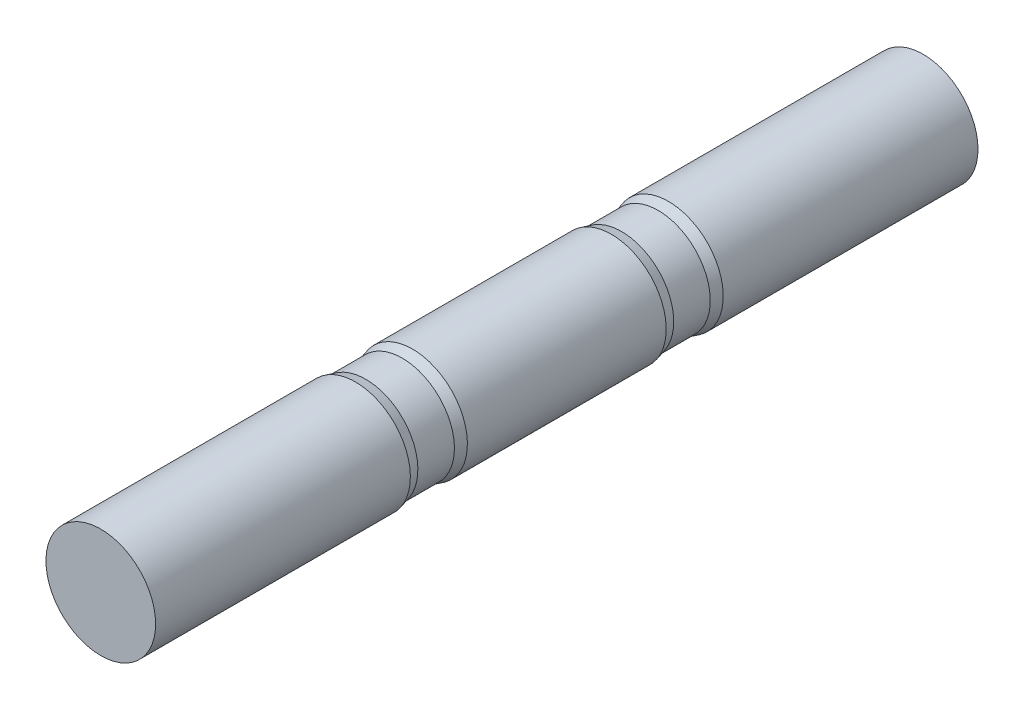
ISO-10303-21;
HEADER;
FILE_DESCRIPTION(('STEP AP214'),'2;1');
FILE_NAME('part.step','',(''),(''),'','','');
FILE_SCHEMA(('AUTOMOTIVE_DESIGN { 1 0 10303 214 1 1 1 1 }'));
ENDSEC;
DATA;
#1=APPLICATION_CONTEXT('core data for automotive mechanical design processes');
#2=APPLICATION_PROTOCOL_DEFINITION('international standard','automotive_design',2000,#1);
#3=PRODUCT_CONTEXT('',#1,'mechanical');
#4=PRODUCT('Part','Part','',(#3));
#5=PRODUCT_RELATED_PRODUCT_CATEGORY('part','',(#4));
#6=PRODUCT_DEFINITION_FORMATION('','',#4);
#7=PRODUCT_DEFINITION_CONTEXT('part definition',#1,'design');
#8=PRODUCT_DEFINITION('design','',#6,#7);
#9=PRODUCT_DEFINITION_SHAPE('','',#8);
#10=(LENGTH_UNIT() NAMED_UNIT(*) SI_UNIT(.MILLI.,.METRE.));
#11=(NAMED_UNIT(*) PLANE_ANGLE_UNIT() SI_UNIT($,.RADIAN.));
#12=(NAMED_UNIT(*) SI_UNIT($,.STERADIAN.) SOLID_ANGLE_UNIT());
#13=UNCERTAINTY_MEASURE_WITH_UNIT(LENGTH_MEASURE(1.E-05),#10,'distance_accuracy_value','');
#14=(GEOMETRIC_REPRESENTATION_CONTEXT(3) GLOBAL_UNCERTAINTY_ASSIGNED_CONTEXT((#13)) GLOBAL_UNIT_ASSIGNED_CONTEXT((#10,
#11,#12)) REPRESENTATION_CONTEXT('',''));
#15=CARTESIAN_POINT('',(0.,0.,0.));
#16=DIRECTION('',(0.,0.,1.));
#17=DIRECTION('',(1.,0.,0.));
#18=AXIS2_PLACEMENT_3D('',#15,#16,#17);
#19=CARTESIAN_POINT('',(0.,0.,225.));
#20=DIRECTION('',(0.,0.,-1.));
#21=DIRECTION('',(-1.,0.,0.));
#22=AXIS2_PLACEMENT_3D('',#19,#20,#21);
#23=CYLINDRICAL_SURFACE('',#22,30.);
#24=CARTESIAN_POINT('',(0.,0.,54.4019237886467));
#25=DIRECTION('',(0.,0.,1.));
#26=DIRECTION('',(0.,-1.,0.));
#27=AXIS2_PLACEMENT_3D('',#24,#25,#26);
#28=CIRCLE('',#27,30.);
#29=CARTESIAN_POINT('',(0.,-30.0000000000001,54.4019237886467));
#30=VERTEX_POINT('',#29);
#31=EDGE_CURVE('E52',#30,#30,#28,.T.);
#32=ORIENTED_EDGE('',*,*,#31,.F.);
#33=EDGE_LOOP('',(#32));
#34=FACE_BOUND('',#33,.T.);
#35=CARTESIAN_POINT('',(0.,0.,-54.4019237886467));
#36=DIRECTION('',(0.,0.,1.));
#37=DIRECTION('',(0.,-1.,0.));
#38=AXIS2_PLACEMENT_3D('',#35,#36,#37);
#39=CIRCLE('',#38,30.);
#40=CARTESIAN_POINT('',(0.,-30.,-54.4019237886467));
#41=VERTEX_POINT('',#40);
#42=EDGE_CURVE('E61',#41,#41,#39,.T.);
#43=ORIENTED_EDGE('',*,*,#42,.T.);
#44=EDGE_LOOP('',(#43));
#45=FACE_BOUND('',#44,.T.);
#46=ADVANCED_FACE('F31',(#34,#45),#23,.T.);
#47=CARTESIAN_POINT('',(0.,0.,225.));
#48=DIRECTION('',(0.,0.,1.));
#49=DIRECTION('',(1.,0.,0.));
#50=AXIS2_PLACEMENT_3D('',#47,#48,#49);
#51=CIRCLE('',#50,30.);
#52=CARTESIAN_POINT('',(30.,0.,225.));
#53=VERTEX_POINT('',#52);
#54=EDGE_CURVE('E10',#53,#53,#51,.T.);
#55=ORIENTED_EDGE('',*,*,#54,.F.);
#56=EDGE_LOOP('',(#55));
#57=FACE_BOUND('',#56,.T.);
#58=CARTESIAN_POINT('',(0.,0.,85.5980762113533));
#59=DIRECTION('',(0.,0.,1.));
#60=DIRECTION('',(0.,-1.,0.));
#61=AXIS2_PLACEMENT_3D('',#58,#59,#60);
#62=CIRCLE('',#61,30.);
#63=CARTESIAN_POINT('',(0.,-30.0000000000001,85.5980762113533));
#64=VERTEX_POINT('',#63);
#65=EDGE_CURVE('E42',#64,#64,#62,.T.);
#66=ORIENTED_EDGE('',*,*,#65,.T.);
#67=EDGE_LOOP('',(#66));
#68=FACE_BOUND('',#67,.T.);
#69=ADVANCED_FACE('F33',(#57,#68),#23,.T.);
#70=CARTESIAN_POINT('',(0.,0.,225.));
#71=DIRECTION('',(0.,0.,1.));
#72=DIRECTION('',(1.,0.,0.));
#73=AXIS2_PLACEMENT_3D('',#70,#71,#72);
#74=PLANE('',#73);
#75=ORIENTED_EDGE('',*,*,#54,.T.);
#76=EDGE_LOOP('',(#75));
#77=FACE_BOUND('',#76,.T.);
#78=ADVANCED_FACE('F83',(#77),#74,.T.);
#79=CARTESIAN_POINT('',(0.,0.,85.5980762113533));
#80=DIRECTION('',(0.,0.,1.));
#81=DIRECTION('',(0.,-1.,0.));
#82=AXIS2_PLACEMENT_3D('',#79,#80,#81);
#83=CONICAL_SURFACE('',#82,30.,0.261799387799149);
#84=CARTESIAN_POINT('',(0.,0.,80.));
#85=DIRECTION('',(0.,0.,1.));
#86=DIRECTION('',(0.,-1.,0.));
#87=AXIS2_PLACEMENT_3D('',#84,#85,#86);
#88=CIRCLE('',#87,28.5);
#89=CARTESIAN_POINT('',(0.,-28.5000000000001,80.));
#90=VERTEX_POINT('',#89);
#91=EDGE_CURVE('E46',#90,#90,#88,.T.);
#92=ORIENTED_EDGE('',*,*,#91,.T.);
#93=EDGE_LOOP('',(#92));
#94=FACE_BOUND('',#93,.T.);
#95=ORIENTED_EDGE('',*,*,#65,.F.);
#96=EDGE_LOOP('',(#95));
#97=FACE_BOUND('',#96,.T.);
#98=ADVANCED_FACE('F88',(#94,#97),#83,.T.);
#99=CARTESIAN_POINT('',(0.,0.,225.));
#100=DIRECTION('',(0.,0.,1.));
#101=DIRECTION('',(0.,-1.,0.));
#102=AXIS2_PLACEMENT_3D('',#99,#100,#101);
#103=CYLINDRICAL_SURFACE('',#102,28.5);
#104=CARTESIAN_POINT('',(0.,0.,60.));
#105=DIRECTION('',(0.,0.,1.));
#106=DIRECTION('',(0.,-1.,0.));
#107=AXIS2_PLACEMENT_3D('',#104,#105,#106);
#108=CIRCLE('',#107,28.5);
#109=CARTESIAN_POINT('',(0.,-28.5000000000001,60.));
#110=VERTEX_POINT('',#109);
#111=EDGE_CURVE('E49',#110,#110,#108,.T.);
#112=ORIENTED_EDGE('',*,*,#111,.T.);
#113=EDGE_LOOP('',(#112));
#114=FACE_BOUND('',#113,.T.);
#115=ORIENTED_EDGE('',*,*,#91,.F.);
#116=EDGE_LOOP('',(#115));
#117=FACE_BOUND('',#116,.T.);
#118=ADVANCED_FACE('F94',(#114,#117),#103,.T.);
#119=CARTESIAN_POINT('',(0.,0.,60.));
#120=DIRECTION('',(0.,0.,-1.));
#121=DIRECTION('',(0.,1.,0.));
#122=AXIS2_PLACEMENT_3D('',#119,#120,#121);
#123=CONICAL_SURFACE('',#122,28.5,0.26179938779915);
#124=ORIENTED_EDGE('',*,*,#31,.T.);
#125=EDGE_LOOP('',(#124));
#126=FACE_BOUND('',#125,.T.);
#127=ORIENTED_EDGE('',*,*,#111,.F.);
#128=EDGE_LOOP('',(#127));
#129=FACE_BOUND('',#128,.T.);
#130=ADVANCED_FACE('F100',(#126,#129),#123,.T.);
#131=CARTESIAN_POINT('',(0.,0.,-80.));
#132=DIRECTION('',(0.,0.,-1.));
#133=DIRECTION('',(0.,1.,0.));
#134=AXIS2_PLACEMENT_3D('',#131,#132,#133);
#135=CONICAL_SURFACE('',#134,28.5,0.261799387799149);
#136=CARTESIAN_POINT('',(0.,0.,-85.5980762113533));
#137=DIRECTION('',(0.,0.,1.));
#138=DIRECTION('',(0.,-1.,0.));
#139=AXIS2_PLACEMENT_3D('',#136,#137,#138);
#140=CIRCLE('',#139,30.);
#141=CARTESIAN_POINT('',(0.,-30.,-85.5980762113533));
#142=VERTEX_POINT('',#141);
#143=EDGE_CURVE('E64',#142,#142,#140,.T.);
#144=ORIENTED_EDGE('',*,*,#143,.T.);
#145=EDGE_LOOP('',(#144));
#146=FACE_BOUND('',#145,.T.);
#147=CARTESIAN_POINT('',(0.,0.,-80.));
#148=DIRECTION('',(0.,0.,1.));
#149=DIRECTION('',(0.,-1.,0.));
#150=AXIS2_PLACEMENT_3D('',#147,#148,#149);
#151=CIRCLE('',#150,28.5);
#152=CARTESIAN_POINT('',(0.,-28.5,-80.));
#153=VERTEX_POINT('',#152);
#154=EDGE_CURVE('E55',#153,#153,#151,.T.);
#155=ORIENTED_EDGE('',*,*,#154,.F.);
#156=EDGE_LOOP('',(#155));
#157=FACE_BOUND('',#156,.T.);
#158=ADVANCED_FACE('F68',(#146,#157),#135,.T.);
#159=CARTESIAN_POINT('',(0.,0.,225.));
#160=DIRECTION('',(0.,0.,1.));
#161=DIRECTION('',(0.,-1.,0.));
#162=AXIS2_PLACEMENT_3D('',#159,#160,#161);
#163=CYLINDRICAL_SURFACE('',#162,28.5);
#164=ORIENTED_EDGE('',*,*,#154,.T.);
#165=EDGE_LOOP('',(#164));
#166=FACE_BOUND('',#165,.T.);
#167=CARTESIAN_POINT('',(0.,0.,-60.));
#168=DIRECTION('',(0.,0.,1.));
#169=DIRECTION('',(0.,-1.,0.));
#170=AXIS2_PLACEMENT_3D('',#167,#168,#169);
#171=CIRCLE('',#170,28.5);
#172=CARTESIAN_POINT('',(0.,-28.5,-60.));
#173=VERTEX_POINT('',#172);
#174=EDGE_CURVE('E58',#173,#173,#171,.T.);
#175=ORIENTED_EDGE('',*,*,#174,.F.);
#176=EDGE_LOOP('',(#175));
#177=FACE_BOUND('',#176,.T.);
#178=ADVANCED_FACE('F109',(#166,#177),#163,.T.);
#179=CARTESIAN_POINT('',(0.,0.,-54.4019237886467));
#180=DIRECTION('',(0.,0.,1.));
#181=DIRECTION('',(0.,-1.,0.));
#182=AXIS2_PLACEMENT_3D('',#179,#180,#181);
#183=CONICAL_SURFACE('',#182,30.,0.261799387799151);
#184=ORIENTED_EDGE('',*,*,#174,.T.);
#185=EDGE_LOOP('',(#184));
#186=FACE_BOUND('',#185,.T.);
#187=ORIENTED_EDGE('',*,*,#42,.F.);
#188=EDGE_LOOP('',(#187));
#189=FACE_BOUND('',#188,.T.);
#190=ADVANCED_FACE('F78',(#186,#189),#183,.T.);
#191=CARTESIAN_POINT('',(0.,0.,-225.));
#192=DIRECTION('',(0.,0.,1.));
#193=DIRECTION('',(1.,0.,0.));
#194=AXIS2_PLACEMENT_3D('',#191,#192,#193);
#195=PLANE('',#194);
#196=CARTESIAN_POINT('',(0.,0.,-225.));
#197=DIRECTION('',(0.,0.,1.));
#198=DIRECTION('',(1.,0.,0.));
#199=AXIS2_PLACEMENT_3D('',#196,#197,#198);
#200=CIRCLE('',#199,30.);
#201=CARTESIAN_POINT('',(30.,0.,-225.));
#202=VERTEX_POINT('',#201);
#203=EDGE_CURVE('E35',#202,#202,#200,.T.);
#204=ORIENTED_EDGE('',*,*,#203,.F.);
#205=EDGE_LOOP('',(#204));
#206=FACE_BOUND('',#205,.T.);
#207=ADVANCED_FACE('F73',(#206),#195,.F.);
#208=ORIENTED_EDGE('',*,*,#203,.T.);
#209=EDGE_LOOP('',(#208));
#210=FACE_BOUND('',#209,.T.);
#211=ORIENTED_EDGE('',*,*,#143,.F.);
#212=EDGE_LOOP('',(#211));
#213=FACE_BOUND('',#212,.T.);
#214=ADVANCED_FACE('F71',(#210,#213),#23,.T.);
#215=CLOSED_SHELL('',(#46,#69,#78,#98,#118,#130,#158,#178,#190,#207,#214));
#216=MANIFOLD_SOLID_BREP('B2',#215);
#217=ADVANCED_BREP_SHAPE_REPRESENTATION('',(#18,#216),#14);
#218=SHAPE_DEFINITION_REPRESENTATION(#9,#217);
ENDSEC;
END-ISO-10303-21;
